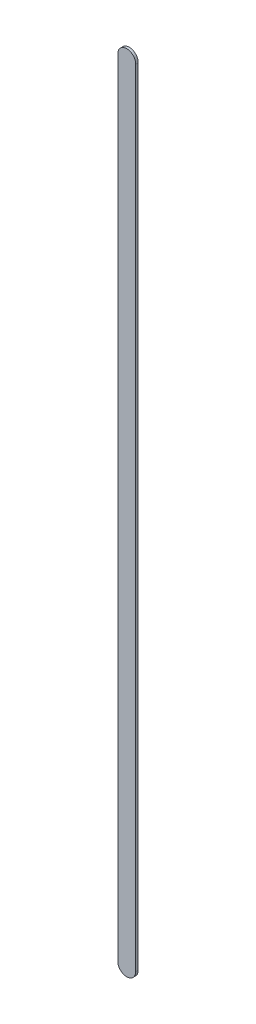
ISO-10303-21;
HEADER;
FILE_DESCRIPTION(('STEP AP214'),'2;1');
FILE_NAME('part.step','',(''),(''),'','','');
FILE_SCHEMA(('AUTOMOTIVE_DESIGN { 1 0 10303 214 1 1 1 1 }'));
ENDSEC;
DATA;
#1=APPLICATION_CONTEXT('core data for automotive mechanical design processes');
#2=APPLICATION_PROTOCOL_DEFINITION('international standard','automotive_design',2000,#1);
#3=PRODUCT_CONTEXT('',#1,'mechanical');
#4=PRODUCT('Part','Part','',(#3));
#5=PRODUCT_RELATED_PRODUCT_CATEGORY('part','',(#4));
#6=PRODUCT_DEFINITION_FORMATION('','',#4);
#7=PRODUCT_DEFINITION_CONTEXT('part definition',#1,'design');
#8=PRODUCT_DEFINITION('design','',#6,#7);
#9=PRODUCT_DEFINITION_SHAPE('','',#8);
#10=(LENGTH_UNIT() NAMED_UNIT(*) SI_UNIT(.MILLI.,.METRE.));
#11=(NAMED_UNIT(*) PLANE_ANGLE_UNIT() SI_UNIT($,.RADIAN.));
#12=(NAMED_UNIT(*) SI_UNIT($,.STERADIAN.) SOLID_ANGLE_UNIT());
#13=UNCERTAINTY_MEASURE_WITH_UNIT(LENGTH_MEASURE(1.E-05),#10,'distance_accuracy_value','');
#14=(GEOMETRIC_REPRESENTATION_CONTEXT(3) GLOBAL_UNCERTAINTY_ASSIGNED_CONTEXT((#13)) GLOBAL_UNIT_ASSIGNED_CONTEXT((#10,
#11,#12)) REPRESENTATION_CONTEXT('',''));
#15=CARTESIAN_POINT('',(0.,0.,0.));
#16=DIRECTION('',(0.,0.,1.));
#17=DIRECTION('',(1.,0.,0.));
#18=AXIS2_PLACEMENT_3D('',#15,#16,#17);
#19=CARTESIAN_POINT('',(100.24397274,84.88697272,0.));
#20=DIRECTION('',(-1.,0.,0.));
#21=DIRECTION('',(0.,1.,0.));
#22=AXIS2_PLACEMENT_3D('',#19,#20,#21);
#23=PLANE('',#22);
#24=DIRECTION('',(0.,1.,0.));
#25=VECTOR('',#24,1.);
#26=CARTESIAN_POINT('',(100.24397274,84.88697272,0.03556));
#27=LINE('',#26,#25);
#28=CARTESIAN_POINT('',(100.24397274,84.88697272,0.03556));
#29=VERTEX_POINT('',#28);
#30=CARTESIAN_POINT('',(100.24397274,95.98697338,0.03556));
#31=VERTEX_POINT('',#30);
#32=EDGE_CURVE('E11',#29,#31,#27,.T.);
#33=ORIENTED_EDGE('',*,*,#32,.F.);
#34=DIRECTION('',(0.,0.,1.));
#35=VECTOR('',#34,1.);
#36=CARTESIAN_POINT('',(100.24397274,84.88697272,0.));
#37=LINE('',#36,#35);
#38=CARTESIAN_POINT('',(100.24397274,84.88697272,0.));
#39=VERTEX_POINT('',#38);
#40=EDGE_CURVE('E24',#39,#29,#37,.T.);
#41=ORIENTED_EDGE('',*,*,#40,.F.);
#42=DIRECTION('',(0.,1.,0.));
#43=VECTOR('',#42,1.);
#44=CARTESIAN_POINT('',(100.24397274,84.88697272,0.));
#45=LINE('',#44,#43);
#46=CARTESIAN_POINT('',(100.24397274,95.98697338,0.));
#47=VERTEX_POINT('',#46);
#48=EDGE_CURVE('E75',#39,#47,#45,.T.);
#49=ORIENTED_EDGE('',*,*,#48,.T.);
#50=DIRECTION('',(0.,0.,1.));
#51=VECTOR('',#50,1.);
#52=CARTESIAN_POINT('',(100.24397274,95.98697338,0.));
#53=LINE('',#52,#51);
#54=EDGE_CURVE('E37',#47,#31,#53,.T.);
#55=ORIENTED_EDGE('',*,*,#54,.T.);
#56=EDGE_LOOP('',(#33,#41,#49,#55));
#57=FACE_BOUND('',#56,.T.);
#58=ADVANCED_FACE('F17',(#57),#23,.F.);
#59=CARTESIAN_POINT('',(100.11697274,95.98697338,0.));
#60=DIRECTION('',(0.,0.,-1.));
#61=DIRECTION('',(1.,0.,0.));
#62=AXIS2_PLACEMENT_3D('',#59,#60,#61);
#63=CYLINDRICAL_SURFACE('',#62,0.127);
#64=CARTESIAN_POINT('',(100.11697274,95.98697338,0.03556));
#65=DIRECTION('',(0.,0.,1.));
#66=DIRECTION('',(1.,0.,0.));
#67=AXIS2_PLACEMENT_3D('',#64,#65,#66);
#68=CIRCLE('',#67,0.127);
#69=CARTESIAN_POINT('',(99.98997274,95.98697338,0.03556));
#70=VERTEX_POINT('',#69);
#71=EDGE_CURVE('E83',#31,#70,#68,.T.);
#72=ORIENTED_EDGE('',*,*,#71,.F.);
#73=ORIENTED_EDGE('',*,*,#54,.F.);
#74=CARTESIAN_POINT('',(100.11697274,95.98697338,0.));
#75=DIRECTION('',(0.,0.,1.));
#76=DIRECTION('',(1.,0.,0.));
#77=AXIS2_PLACEMENT_3D('',#74,#75,#76);
#78=CIRCLE('',#77,0.127);
#79=CARTESIAN_POINT('',(99.98997274,95.98697338,0.));
#80=VERTEX_POINT('',#79);
#81=EDGE_CURVE('E81',#47,#80,#78,.T.);
#82=ORIENTED_EDGE('',*,*,#81,.T.);
#83=DIRECTION('',(0.,0.,1.));
#84=VECTOR('',#83,1.);
#85=CARTESIAN_POINT('',(99.98997274,95.98697338,0.));
#86=LINE('',#85,#84);
#87=EDGE_CURVE('E67',#80,#70,#86,.T.);
#88=ORIENTED_EDGE('',*,*,#87,.T.);
#89=EDGE_LOOP('',(#72,#73,#82,#88));
#90=FACE_BOUND('',#89,.T.);
#91=ADVANCED_FACE('F89',(#90),#63,.T.);
#92=CARTESIAN_POINT('',(99.98997274,95.98697338,0.));
#93=DIRECTION('',(1.,0.,0.));
#94=DIRECTION('',(0.,-1.,0.));
#95=AXIS2_PLACEMENT_3D('',#92,#93,#94);
#96=PLANE('',#95);
#97=DIRECTION('',(0.,-1.,0.));
#98=VECTOR('',#97,1.);
#99=CARTESIAN_POINT('',(99.98997274,95.98697338,0.03556));
#100=LINE('',#99,#98);
#101=CARTESIAN_POINT('',(99.98997274,84.88697272,0.03556));
#102=VERTEX_POINT('',#101);
#103=EDGE_CURVE('E71',#70,#102,#100,.T.);
#104=ORIENTED_EDGE('',*,*,#103,.F.);
#105=ORIENTED_EDGE('',*,*,#87,.F.);
#106=DIRECTION('',(0.,-1.,0.));
#107=VECTOR('',#106,1.);
#108=CARTESIAN_POINT('',(99.98997274,95.98697338,0.));
#109=LINE('',#108,#107);
#110=CARTESIAN_POINT('',(99.98997274,84.88697272,0.));
#111=VERTEX_POINT('',#110);
#112=EDGE_CURVE('E63',#80,#111,#109,.T.);
#113=ORIENTED_EDGE('',*,*,#112,.T.);
#114=DIRECTION('',(0.,0.,1.));
#115=VECTOR('',#114,1.);
#116=CARTESIAN_POINT('',(99.98997274,84.88697272,0.));
#117=LINE('',#116,#115);
#118=EDGE_CURVE('E53',#111,#102,#117,.T.);
#119=ORIENTED_EDGE('',*,*,#118,.T.);
#120=EDGE_LOOP('',(#104,#105,#113,#119));
#121=FACE_BOUND('',#120,.T.);
#122=ADVANCED_FACE('F66',(#121),#96,.F.);
#123=CARTESIAN_POINT('',(100.11697274,84.88697272,0.));
#124=DIRECTION('',(0.,0.,-1.));
#125=DIRECTION('',(-1.,0.,0.));
#126=AXIS2_PLACEMENT_3D('',#123,#124,#125);
#127=CYLINDRICAL_SURFACE('',#126,0.127000000000005);
#128=CARTESIAN_POINT('',(100.11697274,84.88697272,0.03556));
#129=DIRECTION('',(0.,0.,1.));
#130=DIRECTION('',(-1.,0.,0.));
#131=AXIS2_PLACEMENT_3D('',#128,#129,#130);
#132=CIRCLE('',#131,0.127000000000005);
#133=EDGE_CURVE('E59',#102,#29,#132,.T.);
#134=ORIENTED_EDGE('',*,*,#133,.F.);
#135=ORIENTED_EDGE('',*,*,#118,.F.);
#136=CARTESIAN_POINT('',(100.11697274,84.88697272,0.));
#137=DIRECTION('',(0.,0.,1.));
#138=DIRECTION('',(-1.,0.,0.));
#139=AXIS2_PLACEMENT_3D('',#136,#137,#138);
#140=CIRCLE('',#139,0.127000000000005);
#141=EDGE_CURVE('E57',#111,#39,#140,.T.);
#142=ORIENTED_EDGE('',*,*,#141,.T.);
#143=ORIENTED_EDGE('',*,*,#40,.T.);
#144=EDGE_LOOP('',(#134,#135,#142,#143));
#145=FACE_BOUND('',#144,.T.);
#146=ADVANCED_FACE('F55',(#145),#127,.T.);
#147=CARTESIAN_POINT('',(100.24397274,84.88697272,0.));
#148=DIRECTION('',(0.,0.,-1.));
#149=DIRECTION('',(-1.,0.,0.));
#150=AXIS2_PLACEMENT_3D('',#147,#148,#149);
#151=PLANE('',#150);
#152=ORIENTED_EDGE('',*,*,#141,.F.);
#153=ORIENTED_EDGE('',*,*,#112,.F.);
#154=ORIENTED_EDGE('',*,*,#81,.F.);
#155=ORIENTED_EDGE('',*,*,#48,.F.);
#156=EDGE_LOOP('',(#152,#153,#154,#155));
#157=FACE_BOUND('',#156,.T.);
#158=ADVANCED_FACE('F74',(#157),#151,.T.);
#159=CARTESIAN_POINT('',(100.24397274,84.88697272,0.03556));
#160=DIRECTION('',(0.,0.,-1.));
#161=DIRECTION('',(-1.,0.,0.));
#162=AXIS2_PLACEMENT_3D('',#159,#160,#161);
#163=PLANE('',#162);
#164=ORIENTED_EDGE('',*,*,#32,.T.);
#165=ORIENTED_EDGE('',*,*,#71,.T.);
#166=ORIENTED_EDGE('',*,*,#103,.T.);
#167=ORIENTED_EDGE('',*,*,#133,.T.);
#168=EDGE_LOOP('',(#164,#165,#166,#167));
#169=FACE_BOUND('',#168,.T.);
#170=ADVANCED_FACE('F91',(#169),#163,.F.);
#171=CLOSED_SHELL('',(#58,#91,#122,#146,#158,#170));
#172=MANIFOLD_SOLID_BREP('B1',#171);
#173=ADVANCED_BREP_SHAPE_REPRESENTATION('',(#18,#172),#14);
#174=SHAPE_DEFINITION_REPRESENTATION(#9,#173);
ENDSEC;
END-ISO-10303-21;
